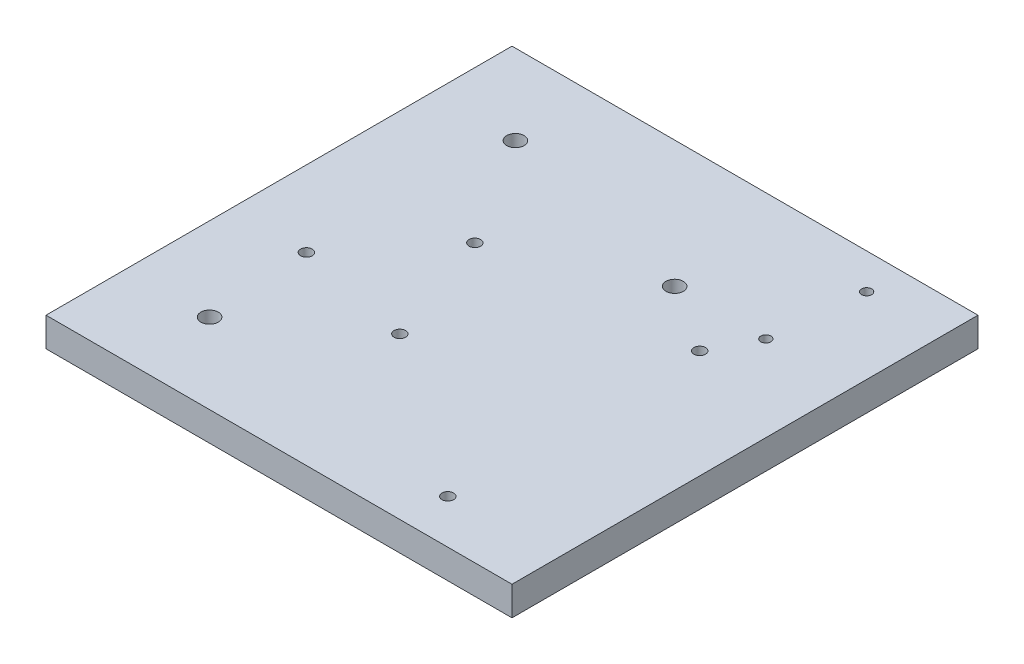
ISO-10303-21;
HEADER;
FILE_DESCRIPTION(('STEP AP214'),'2;1');
FILE_NAME('part.step','',(''),(''),'','','');
FILE_SCHEMA(('AUTOMOTIVE_DESIGN { 1 0 10303 214 1 1 1 1 }'));
ENDSEC;
DATA;
#1=APPLICATION_CONTEXT('core data for automotive mechanical design processes');
#2=APPLICATION_PROTOCOL_DEFINITION('international standard','automotive_design',2000,#1);
#3=PRODUCT_CONTEXT('',#1,'mechanical');
#4=PRODUCT('Part','Part','',(#3));
#5=PRODUCT_RELATED_PRODUCT_CATEGORY('part','',(#4));
#6=PRODUCT_DEFINITION_FORMATION('','',#4);
#7=PRODUCT_DEFINITION_CONTEXT('part definition',#1,'design');
#8=PRODUCT_DEFINITION('design','',#6,#7);
#9=PRODUCT_DEFINITION_SHAPE('','',#8);
#10=(LENGTH_UNIT() NAMED_UNIT(*) SI_UNIT(.MILLI.,.METRE.));
#11=(NAMED_UNIT(*) PLANE_ANGLE_UNIT() SI_UNIT($,.RADIAN.));
#12=(NAMED_UNIT(*) SI_UNIT($,.STERADIAN.) SOLID_ANGLE_UNIT());
#13=UNCERTAINTY_MEASURE_WITH_UNIT(LENGTH_MEASURE(1.E-05),#10,'distance_accuracy_value','');
#14=(GEOMETRIC_REPRESENTATION_CONTEXT(3) GLOBAL_UNCERTAINTY_ASSIGNED_CONTEXT((#13)) GLOBAL_UNIT_ASSIGNED_CONTEXT((#10,
#11,#12)) REPRESENTATION_CONTEXT('',''));
#15=CARTESIAN_POINT('',(0.,0.,0.));
#16=DIRECTION('',(0.,0.,1.));
#17=DIRECTION('',(1.,0.,0.));
#18=AXIS2_PLACEMENT_3D('',#15,#16,#17);
#19=CARTESIAN_POINT('',(-50.8,6.35,50.8));
#20=DIRECTION('',(1.,0.,0.));
#21=DIRECTION('',(0.,0.,-1.));
#22=AXIS2_PLACEMENT_3D('',#19,#20,#21);
#23=PLANE('',#22);
#24=DIRECTION('',(0.,0.,1.));
#25=VECTOR('',#24,1.);
#26=CARTESIAN_POINT('',(-50.8,0.,50.8));
#27=LINE('',#26,#25);
#28=CARTESIAN_POINT('',(-50.8,0.,-50.8));
#29=VERTEX_POINT('',#28);
#30=CARTESIAN_POINT('',(-50.8,0.,50.8));
#31=VERTEX_POINT('',#30);
#32=EDGE_CURVE('E96',#29,#31,#27,.T.);
#33=ORIENTED_EDGE('',*,*,#32,.T.);
#34=DIRECTION('',(0.,-1.,0.));
#35=VECTOR('',#34,1.);
#36=CARTESIAN_POINT('',(-50.8,6.35,50.8));
#37=LINE('',#36,#35);
#38=CARTESIAN_POINT('',(-50.8,6.35,50.8));
#39=VERTEX_POINT('',#38);
#40=EDGE_CURVE('E11',#39,#31,#37,.T.);
#41=ORIENTED_EDGE('',*,*,#40,.F.);
#42=DIRECTION('',(0.,0.,1.));
#43=VECTOR('',#42,1.);
#44=CARTESIAN_POINT('',(-50.8,6.35,50.8));
#45=LINE('',#44,#43);
#46=CARTESIAN_POINT('',(-50.8,6.35,-50.8));
#47=VERTEX_POINT('',#46);
#48=EDGE_CURVE('E84',#47,#39,#45,.T.);
#49=ORIENTED_EDGE('',*,*,#48,.F.);
#50=DIRECTION('',(0.,-1.,0.));
#51=VECTOR('',#50,1.);
#52=CARTESIAN_POINT('',(-50.8,6.35,-50.8));
#53=LINE('',#52,#51);
#54=EDGE_CURVE('E92',#47,#29,#53,.T.);
#55=ORIENTED_EDGE('',*,*,#54,.T.);
#56=EDGE_LOOP('',(#33,#41,#49,#55));
#57=FACE_BOUND('',#56,.T.);
#58=ADVANCED_FACE('F33',(#57),#23,.F.);
#59=CARTESIAN_POINT('',(50.8,6.35,50.8));
#60=DIRECTION('',(0.,0.,-1.));
#61=DIRECTION('',(-1.,0.,0.));
#62=AXIS2_PLACEMENT_3D('',#59,#60,#61);
#63=PLANE('',#62);
#64=DIRECTION('',(1.,0.,0.));
#65=VECTOR('',#64,1.);
#66=CARTESIAN_POINT('',(50.8,0.,50.8));
#67=LINE('',#66,#65);
#68=CARTESIAN_POINT('',(50.8,0.,50.8));
#69=VERTEX_POINT('',#68);
#70=EDGE_CURVE('E88',#31,#69,#67,.T.);
#71=ORIENTED_EDGE('',*,*,#70,.T.);
#72=DIRECTION('',(0.,-1.,0.));
#73=VECTOR('',#72,1.);
#74=CARTESIAN_POINT('',(50.8,6.35,50.8));
#75=LINE('',#74,#73);
#76=CARTESIAN_POINT('',(50.8,6.35,50.8));
#77=VERTEX_POINT('',#76);
#78=EDGE_CURVE('E41',#77,#69,#75,.T.);
#79=ORIENTED_EDGE('',*,*,#78,.F.);
#80=DIRECTION('',(1.,0.,0.));
#81=VECTOR('',#80,1.);
#82=CARTESIAN_POINT('',(50.8,6.35,50.8));
#83=LINE('',#82,#81);
#84=EDGE_CURVE('E79',#39,#77,#83,.T.);
#85=ORIENTED_EDGE('',*,*,#84,.F.);
#86=ORIENTED_EDGE('',*,*,#40,.T.);
#87=EDGE_LOOP('',(#71,#79,#85,#86));
#88=FACE_BOUND('',#87,.T.);
#89=ADVANCED_FACE('F87',(#88),#63,.F.);
#90=CARTESIAN_POINT('',(50.8,6.35,50.8));
#91=DIRECTION('',(-1.,0.,0.));
#92=DIRECTION('',(0.,0.,1.));
#93=AXIS2_PLACEMENT_3D('',#90,#91,#92);
#94=PLANE('',#93);
#95=DIRECTION('',(0.,0.,-1.));
#96=VECTOR('',#95,1.);
#97=CARTESIAN_POINT('',(50.8,0.,50.8));
#98=LINE('',#97,#96);
#99=CARTESIAN_POINT('',(50.8,0.,-50.8));
#100=VERTEX_POINT('',#99);
#101=EDGE_CURVE('E66',#69,#100,#98,.T.);
#102=ORIENTED_EDGE('',*,*,#101,.T.);
#103=DIRECTION('',(0.,-1.,0.));
#104=VECTOR('',#103,1.);
#105=CARTESIAN_POINT('',(50.8,6.35,-50.8));
#106=LINE('',#105,#104);
#107=CARTESIAN_POINT('',(50.8,6.35,-50.8));
#108=VERTEX_POINT('',#107);
#109=EDGE_CURVE('E89',#108,#100,#106,.T.);
#110=ORIENTED_EDGE('',*,*,#109,.F.);
#111=DIRECTION('',(0.,0.,-1.));
#112=VECTOR('',#111,1.);
#113=CARTESIAN_POINT('',(50.8,6.35,50.8));
#114=LINE('',#113,#112);
#115=EDGE_CURVE('E82',#77,#108,#114,.T.);
#116=ORIENTED_EDGE('',*,*,#115,.F.);
#117=ORIENTED_EDGE('',*,*,#78,.T.);
#118=EDGE_LOOP('',(#102,#110,#116,#117));
#119=FACE_BOUND('',#118,.T.);
#120=ADVANCED_FACE('F90',(#119),#94,.F.);
#121=CARTESIAN_POINT('',(50.8,6.35,-50.8));
#122=DIRECTION('',(0.,0.,1.));
#123=DIRECTION('',(1.,0.,0.));
#124=AXIS2_PLACEMENT_3D('',#121,#122,#123);
#125=PLANE('',#124);
#126=DIRECTION('',(-1.,0.,0.));
#127=VECTOR('',#126,1.);
#128=CARTESIAN_POINT('',(50.8,0.,-50.8));
#129=LINE('',#128,#127);
#130=EDGE_CURVE('E72',#100,#29,#129,.T.);
#131=ORIENTED_EDGE('',*,*,#130,.T.);
#132=ORIENTED_EDGE('',*,*,#54,.F.);
#133=DIRECTION('',(-1.,0.,0.));
#134=VECTOR('',#133,1.);
#135=CARTESIAN_POINT('',(50.8,6.35,-50.8));
#136=LINE('',#135,#134);
#137=EDGE_CURVE('E49',#108,#47,#136,.T.);
#138=ORIENTED_EDGE('',*,*,#137,.F.);
#139=ORIENTED_EDGE('',*,*,#109,.T.);
#140=EDGE_LOOP('',(#131,#132,#138,#139));
#141=FACE_BOUND('',#140,.T.);
#142=ADVANCED_FACE('F104',(#141),#125,.F.);
#143=CARTESIAN_POINT('',(-50.8,6.35,-50.8));
#144=DIRECTION('',(0.,1.,0.));
#145=DIRECTION('',(0.,0.,1.));
#146=AXIS2_PLACEMENT_3D('',#143,#144,#145);
#147=PLANE('',#146);
#148=CARTESIAN_POINT('',(32.1481788724814,6.35,-23.1914174439432));
#149=DIRECTION('',(0.,1.,0.));
#150=DIRECTION('',(0.,0.,1.));
#151=AXIS2_PLACEMENT_3D('',#148,#149,#150);
#152=CIRCLE('',#151,1.09999999999999);
#153=CARTESIAN_POINT('',(32.1481788724814,6.35,-22.0914174439432));
#154=VERTEX_POINT('',#153);
#155=EDGE_CURVE('E164',#154,#154,#152,.T.);
#156=ORIENTED_EDGE('',*,*,#155,.F.);
#157=EDGE_LOOP('',(#156));
#158=FACE_BOUND('',#157,.T.);
#159=CARTESIAN_POINT('',(34.2387481378345,6.35,-43.0818553513086));
#160=DIRECTION('',(0.,1.,0.));
#161=DIRECTION('',(0.,0.,1.));
#162=AXIS2_PLACEMENT_3D('',#159,#160,#161);
#163=CIRCLE('',#162,1.09999999999999);
#164=CARTESIAN_POINT('',(34.2387481378345,6.35,-41.9818553513086));
#165=VERTEX_POINT('',#164);
#166=EDGE_CURVE('E158',#165,#165,#163,.T.);
#167=ORIENTED_EDGE('',*,*,#166,.F.);
#168=EDGE_LOOP('',(#167));
#169=FACE_BOUND('',#168,.T.);
#170=CARTESIAN_POINT('',(12.2807386859692,6.35,-23.1774999999993));
#171=DIRECTION('',(0.,1.,0.));
#172=DIRECTION('',(0.,0.,1.));
#173=AXIS2_PLACEMENT_3D('',#170,#171,#172);
#174=CIRCLE('',#173,1.89865);
#175=CARTESIAN_POINT('',(12.2807386859692,6.35,-21.2788499999993));
#176=VERTEX_POINT('',#175);
#177=EDGE_CURVE('E152',#176,#176,#174,.T.);
#178=ORIENTED_EDGE('',*,*,#177,.F.);
#179=EDGE_LOOP('',(#178));
#180=FACE_BOUND('',#179,.T.);
#181=CARTESIAN_POINT('',(-32.6007386859686,6.35,33.3375000000003));
#182=DIRECTION('',(0.,-1.,0.));
#183=DIRECTION('',(0.,0.,-1.));
#184=AXIS2_PLACEMENT_3D('',#181,#182,#183);
#185=CIRCLE('',#184,1.89865);
#186=CARTESIAN_POINT('',(-32.6007386859686,6.35,31.4388500000003));
#187=VERTEX_POINT('',#186);
#188=EDGE_CURVE('E143',#187,#187,#185,.T.);
#189=ORIENTED_EDGE('',*,*,#188,.T.);
#190=EDGE_LOOP('',(#189));
#191=FACE_BOUND('',#190,.T.);
#192=CARTESIAN_POINT('',(-32.6007386859686,6.35,-33.3374999999997));
#193=DIRECTION('',(0.,-1.,0.));
#194=DIRECTION('',(0.,0.,-1.));
#195=AXIS2_PLACEMENT_3D('',#192,#193,#194);
#196=CIRCLE('',#195,1.89865);
#197=CARTESIAN_POINT('',(-32.6007386859686,6.35,-35.2361499999997));
#198=VERTEX_POINT('',#197);
#199=EDGE_CURVE('E137',#198,#198,#196,.T.);
#200=ORIENTED_EDGE('',*,*,#199,.T.);
#201=EDGE_LOOP('',(#200));
#202=FACE_BOUND('',#201,.T.);
#203=CARTESIAN_POINT('',(27.2,6.35,-13.7211770524215));
#204=DIRECTION('',(0.,-1.,0.));
#205=DIRECTION('',(0.,0.,-1.));
#206=AXIS2_PLACEMENT_3D('',#203,#204,#205);
#207=CIRCLE('',#206,1.27000000000005);
#208=CARTESIAN_POINT('',(27.2,6.35,-14.9911770524216));
#209=VERTEX_POINT('',#208);
#210=EDGE_CURVE('E131',#209,#209,#207,.T.);
#211=ORIENTED_EDGE('',*,*,#210,.T.);
#212=EDGE_LOOP('',(#211));
#213=FACE_BOUND('',#212,.T.);
#214=CARTESIAN_POINT('',(27.2,6.35,41.1988229475785));
#215=DIRECTION('',(0.,-1.,0.));
#216=DIRECTION('',(0.,0.,-1.));
#217=AXIS2_PLACEMENT_3D('',#214,#215,#216);
#218=CIRCLE('',#217,1.27000000000005);
#219=CARTESIAN_POINT('',(27.2,6.35,39.9288229475784));
#220=VERTEX_POINT('',#219);
#221=EDGE_CURVE('E125',#220,#220,#218,.T.);
#222=ORIENTED_EDGE('',*,*,#221,.T.);
#223=EDGE_LOOP('',(#222));
#224=FACE_BOUND('',#223,.T.);
#225=CARTESIAN_POINT('',(-17.7149310523231,6.35,-9.61074588253205));
#226=DIRECTION('',(0.,-1.,0.));
#227=DIRECTION('',(0.,0.,-1.));
#228=AXIS2_PLACEMENT_3D('',#225,#226,#227);
#229=CIRCLE('',#228,1.26999999999999);
#230=CARTESIAN_POINT('',(-17.7149310523231,6.35,-10.880745882532));
#231=VERTEX_POINT('',#230);
#232=EDGE_CURVE('E119',#231,#231,#229,.T.);
#233=ORIENTED_EDGE('',*,*,#232,.T.);
#234=EDGE_LOOP('',(#233));
#235=FACE_BOUND('',#234,.T.);
#236=CARTESIAN_POINT('',(-34.2625629227483,6.35,10.563822947579));
#237=DIRECTION('',(0.,-1.,0.));
#238=DIRECTION('',(0.,0.,-1.));
#239=AXIS2_PLACEMENT_3D('',#236,#237,#238);
#240=CIRCLE('',#239,1.27000000000001);
#241=CARTESIAN_POINT('',(-34.2625629227483,6.35,9.29382294757898));
#242=VERTEX_POINT('',#241);
#243=EDGE_CURVE('E113',#242,#242,#240,.T.);
#244=ORIENTED_EDGE('',*,*,#243,.T.);
#245=EDGE_LOOP('',(#244));
#246=FACE_BOUND('',#245,.T.);
#247=CARTESIAN_POINT('',(-8.69154602444201,6.35,15.7561675804543));
#248=DIRECTION('',(0.,-1.,0.));
#249=DIRECTION('',(0.,0.,-1.));
#250=AXIS2_PLACEMENT_3D('',#247,#248,#249);
#251=CIRCLE('',#250,1.26999999999987);
#252=CARTESIAN_POINT('',(-8.69154602444201,6.35,14.4861675804545));
#253=VERTEX_POINT('',#252);
#254=EDGE_CURVE('E99',#253,#253,#251,.T.);
#255=ORIENTED_EDGE('',*,*,#254,.T.);
#256=EDGE_LOOP('',(#255));
#257=FACE_BOUND('',#256,.T.);
#258=ORIENTED_EDGE('',*,*,#48,.T.);
#259=ORIENTED_EDGE('',*,*,#84,.T.);
#260=ORIENTED_EDGE('',*,*,#115,.T.);
#261=ORIENTED_EDGE('',*,*,#137,.T.);
#262=EDGE_LOOP('',(#258,#259,#260,#261));
#263=FACE_BOUND('',#262,.T.);
#264=ADVANCED_FACE('F80',(#158,#169,#180,#191,#202,#213,#224,#235,#246,#257,#263),#147,.T.);
#265=CARTESIAN_POINT('',(-50.8,0.,-50.8));
#266=DIRECTION('',(0.,1.,0.));
#267=DIRECTION('',(0.,0.,1.));
#268=AXIS2_PLACEMENT_3D('',#265,#266,#267);
#269=PLANE('',#268);
#270=CARTESIAN_POINT('',(32.1481788724814,0.,-23.1914174439432));
#271=DIRECTION('',(0.,1.,0.));
#272=DIRECTION('',(0.,0.,1.));
#273=AXIS2_PLACEMENT_3D('',#270,#271,#272);
#274=CIRCLE('',#273,1.09999999999999);
#275=CARTESIAN_POINT('',(32.1481788724814,0.,-22.0914174439432));
#276=VERTEX_POINT('',#275);
#277=EDGE_CURVE('E161',#276,#276,#274,.T.);
#278=ORIENTED_EDGE('',*,*,#277,.T.);
#279=EDGE_LOOP('',(#278));
#280=FACE_BOUND('',#279,.T.);
#281=CARTESIAN_POINT('',(34.2387481378345,0.,-43.0818553513086));
#282=DIRECTION('',(0.,1.,0.));
#283=DIRECTION('',(0.,0.,1.));
#284=AXIS2_PLACEMENT_3D('',#281,#282,#283);
#285=CIRCLE('',#284,1.09999999999999);
#286=CARTESIAN_POINT('',(34.2387481378345,0.,-41.9818553513086));
#287=VERTEX_POINT('',#286);
#288=EDGE_CURVE('E155',#287,#287,#285,.T.);
#289=ORIENTED_EDGE('',*,*,#288,.T.);
#290=EDGE_LOOP('',(#289));
#291=FACE_BOUND('',#290,.T.);
#292=CARTESIAN_POINT('',(12.2807386859692,0.,-23.1774999999993));
#293=DIRECTION('',(0.,1.,0.));
#294=DIRECTION('',(0.,0.,1.));
#295=AXIS2_PLACEMENT_3D('',#292,#293,#294);
#296=CIRCLE('',#295,1.89865);
#297=CARTESIAN_POINT('',(12.2807386859692,0.,-21.2788499999993));
#298=VERTEX_POINT('',#297);
#299=EDGE_CURVE('E149',#298,#298,#296,.T.);
#300=ORIENTED_EDGE('',*,*,#299,.T.);
#301=EDGE_LOOP('',(#300));
#302=FACE_BOUND('',#301,.T.);
#303=CARTESIAN_POINT('',(-32.6007386859686,0.,33.3375000000003));
#304=DIRECTION('',(0.,-1.,0.));
#305=DIRECTION('',(0.,0.,-1.));
#306=AXIS2_PLACEMENT_3D('',#303,#304,#305);
#307=CIRCLE('',#306,1.89865);
#308=CARTESIAN_POINT('',(-32.6007386859686,0.,31.4388500000003));
#309=VERTEX_POINT('',#308);
#310=EDGE_CURVE('E146',#309,#309,#307,.T.);
#311=ORIENTED_EDGE('',*,*,#310,.F.);
#312=EDGE_LOOP('',(#311));
#313=FACE_BOUND('',#312,.T.);
#314=CARTESIAN_POINT('',(-32.6007386859686,0.,-33.3374999999997));
#315=DIRECTION('',(0.,-1.,0.));
#316=DIRECTION('',(0.,0.,-1.));
#317=AXIS2_PLACEMENT_3D('',#314,#315,#316);
#318=CIRCLE('',#317,1.89865);
#319=CARTESIAN_POINT('',(-32.6007386859686,0.,-35.2361499999997));
#320=VERTEX_POINT('',#319);
#321=EDGE_CURVE('E140',#320,#320,#318,.T.);
#322=ORIENTED_EDGE('',*,*,#321,.F.);
#323=EDGE_LOOP('',(#322));
#324=FACE_BOUND('',#323,.T.);
#325=CARTESIAN_POINT('',(27.2,0.,-13.7211770524215));
#326=DIRECTION('',(0.,-1.,0.));
#327=DIRECTION('',(0.,0.,-1.));
#328=AXIS2_PLACEMENT_3D('',#325,#326,#327);
#329=CIRCLE('',#328,1.27000000000005);
#330=CARTESIAN_POINT('',(27.2,0.,-14.9911770524216));
#331=VERTEX_POINT('',#330);
#332=EDGE_CURVE('E134',#331,#331,#329,.T.);
#333=ORIENTED_EDGE('',*,*,#332,.F.);
#334=EDGE_LOOP('',(#333));
#335=FACE_BOUND('',#334,.T.);
#336=CARTESIAN_POINT('',(27.2,0.,41.1988229475785));
#337=DIRECTION('',(0.,-1.,0.));
#338=DIRECTION('',(0.,0.,-1.));
#339=AXIS2_PLACEMENT_3D('',#336,#337,#338);
#340=CIRCLE('',#339,1.27000000000005);
#341=CARTESIAN_POINT('',(27.2,0.,39.9288229475784));
#342=VERTEX_POINT('',#341);
#343=EDGE_CURVE('E128',#342,#342,#340,.T.);
#344=ORIENTED_EDGE('',*,*,#343,.F.);
#345=EDGE_LOOP('',(#344));
#346=FACE_BOUND('',#345,.T.);
#347=CARTESIAN_POINT('',(-17.7149310523231,0.,-9.61074588253205));
#348=DIRECTION('',(0.,-1.,0.));
#349=DIRECTION('',(0.,0.,-1.));
#350=AXIS2_PLACEMENT_3D('',#347,#348,#349);
#351=CIRCLE('',#350,1.26999999999999);
#352=CARTESIAN_POINT('',(-17.7149310523231,0.,-10.880745882532));
#353=VERTEX_POINT('',#352);
#354=EDGE_CURVE('E122',#353,#353,#351,.T.);
#355=ORIENTED_EDGE('',*,*,#354,.F.);
#356=EDGE_LOOP('',(#355));
#357=FACE_BOUND('',#356,.T.);
#358=CARTESIAN_POINT('',(-34.2625629227483,0.,10.563822947579));
#359=DIRECTION('',(0.,-1.,0.));
#360=DIRECTION('',(0.,0.,-1.));
#361=AXIS2_PLACEMENT_3D('',#358,#359,#360);
#362=CIRCLE('',#361,1.27000000000001);
#363=CARTESIAN_POINT('',(-34.2625629227483,0.,9.29382294757898));
#364=VERTEX_POINT('',#363);
#365=EDGE_CURVE('E116',#364,#364,#362,.T.);
#366=ORIENTED_EDGE('',*,*,#365,.F.);
#367=EDGE_LOOP('',(#366));
#368=FACE_BOUND('',#367,.T.);
#369=CARTESIAN_POINT('',(-8.69154602444201,0.,15.7561675804543));
#370=DIRECTION('',(0.,-1.,0.));
#371=DIRECTION('',(0.,0.,-1.));
#372=AXIS2_PLACEMENT_3D('',#369,#370,#371);
#373=CIRCLE('',#372,1.26999999999987);
#374=CARTESIAN_POINT('',(-8.69154602444201,0.,14.4861675804545));
#375=VERTEX_POINT('',#374);
#376=EDGE_CURVE('E110',#375,#375,#373,.T.);
#377=ORIENTED_EDGE('',*,*,#376,.F.);
#378=EDGE_LOOP('',(#377));
#379=FACE_BOUND('',#378,.T.);
#380=ORIENTED_EDGE('',*,*,#32,.F.);
#381=ORIENTED_EDGE('',*,*,#130,.F.);
#382=ORIENTED_EDGE('',*,*,#101,.F.);
#383=ORIENTED_EDGE('',*,*,#70,.F.);
#384=EDGE_LOOP('',(#380,#381,#382,#383));
#385=FACE_BOUND('',#384,.T.);
#386=ADVANCED_FACE('F107',(#280,#291,#302,#313,#324,#335,#346,#357,#368,#379,#385),#269,.F.);
#387=CARTESIAN_POINT('',(-8.69154602444201,6.35,15.7561675804543));
#388=DIRECTION('',(0.,-1.,0.));
#389=DIRECTION('',(0.,0.,-1.));
#390=AXIS2_PLACEMENT_3D('',#387,#388,#389);
#391=CYLINDRICAL_SURFACE('',#390,1.26999999999987);
#392=ORIENTED_EDGE('',*,*,#254,.F.);
#393=EDGE_LOOP('',(#392));
#394=FACE_BOUND('',#393,.T.);
#395=ORIENTED_EDGE('',*,*,#376,.T.);
#396=EDGE_LOOP('',(#395));
#397=FACE_BOUND('',#396,.T.);
#398=ADVANCED_FACE('F200',(#394,#397),#391,.F.);
#399=CARTESIAN_POINT('',(-34.2625629227483,6.35,10.563822947579));
#400=DIRECTION('',(0.,-1.,0.));
#401=DIRECTION('',(0.,0.,-1.));
#402=AXIS2_PLACEMENT_3D('',#399,#400,#401);
#403=CYLINDRICAL_SURFACE('',#402,1.27000000000001);
#404=ORIENTED_EDGE('',*,*,#243,.F.);
#405=EDGE_LOOP('',(#404));
#406=FACE_BOUND('',#405,.T.);
#407=ORIENTED_EDGE('',*,*,#365,.T.);
#408=EDGE_LOOP('',(#407));
#409=FACE_BOUND('',#408,.T.);
#410=ADVANCED_FACE('F203',(#406,#409),#403,.F.);
#411=CARTESIAN_POINT('',(-17.7149310523231,6.35,-9.61074588253205));
#412=DIRECTION('',(0.,-1.,0.));
#413=DIRECTION('',(0.,0.,-1.));
#414=AXIS2_PLACEMENT_3D('',#411,#412,#413);
#415=CYLINDRICAL_SURFACE('',#414,1.26999999999999);
#416=ORIENTED_EDGE('',*,*,#232,.F.);
#417=EDGE_LOOP('',(#416));
#418=FACE_BOUND('',#417,.T.);
#419=ORIENTED_EDGE('',*,*,#354,.T.);
#420=EDGE_LOOP('',(#419));
#421=FACE_BOUND('',#420,.T.);
#422=ADVANCED_FACE('F291',(#418,#421),#415,.F.);
#423=CARTESIAN_POINT('',(27.2,6.35,41.1988229475785));
#424=DIRECTION('',(0.,-1.,0.));
#425=DIRECTION('',(0.,0.,-1.));
#426=AXIS2_PLACEMENT_3D('',#423,#424,#425);
#427=CYLINDRICAL_SURFACE('',#426,1.27000000000005);
#428=ORIENTED_EDGE('',*,*,#221,.F.);
#429=EDGE_LOOP('',(#428));
#430=FACE_BOUND('',#429,.T.);
#431=ORIENTED_EDGE('',*,*,#343,.T.);
#432=EDGE_LOOP('',(#431));
#433=FACE_BOUND('',#432,.T.);
#434=ADVANCED_FACE('F283',(#430,#433),#427,.F.);
#435=CARTESIAN_POINT('',(27.2,6.35,-13.7211770524215));
#436=DIRECTION('',(0.,-1.,0.));
#437=DIRECTION('',(0.,0.,-1.));
#438=AXIS2_PLACEMENT_3D('',#435,#436,#437);
#439=CYLINDRICAL_SURFACE('',#438,1.27000000000005);
#440=ORIENTED_EDGE('',*,*,#210,.F.);
#441=EDGE_LOOP('',(#440));
#442=FACE_BOUND('',#441,.T.);
#443=ORIENTED_EDGE('',*,*,#332,.T.);
#444=EDGE_LOOP('',(#443));
#445=FACE_BOUND('',#444,.T.);
#446=ADVANCED_FACE('F275',(#442,#445),#439,.F.);
#447=CARTESIAN_POINT('',(-32.6007386859686,6.35,-33.3374999999997));
#448=DIRECTION('',(0.,-1.,0.));
#449=DIRECTION('',(0.,0.,-1.));
#450=AXIS2_PLACEMENT_3D('',#447,#448,#449);
#451=CYLINDRICAL_SURFACE('',#450,1.89865);
#452=ORIENTED_EDGE('',*,*,#199,.F.);
#453=EDGE_LOOP('',(#452));
#454=FACE_BOUND('',#453,.T.);
#455=ORIENTED_EDGE('',*,*,#321,.T.);
#456=EDGE_LOOP('',(#455));
#457=FACE_BOUND('',#456,.T.);
#458=ADVANCED_FACE('F267',(#454,#457),#451,.F.);
#459=CARTESIAN_POINT('',(-32.6007386859686,6.35,33.3375000000003));
#460=DIRECTION('',(0.,-1.,0.));
#461=DIRECTION('',(0.,0.,-1.));
#462=AXIS2_PLACEMENT_3D('',#459,#460,#461);
#463=CYLINDRICAL_SURFACE('',#462,1.89865);
#464=ORIENTED_EDGE('',*,*,#188,.F.);
#465=EDGE_LOOP('',(#464));
#466=FACE_BOUND('',#465,.T.);
#467=ORIENTED_EDGE('',*,*,#310,.T.);
#468=EDGE_LOOP('',(#467));
#469=FACE_BOUND('',#468,.T.);
#470=ADVANCED_FACE('F262',(#466,#469),#463,.F.);
#471=CARTESIAN_POINT('',(12.2807386859692,0.,-23.1774999999993));
#472=DIRECTION('',(0.,1.,0.));
#473=DIRECTION('',(0.,0.,1.));
#474=AXIS2_PLACEMENT_3D('',#471,#472,#473);
#475=CYLINDRICAL_SURFACE('',#474,1.89865);
#476=ORIENTED_EDGE('',*,*,#299,.F.);
#477=EDGE_LOOP('',(#476));
#478=FACE_BOUND('',#477,.T.);
#479=ORIENTED_EDGE('',*,*,#177,.T.);
#480=EDGE_LOOP('',(#479));
#481=FACE_BOUND('',#480,.T.);
#482=ADVANCED_FACE('F236',(#478,#481),#475,.F.);
#483=CARTESIAN_POINT('',(34.2387481378345,0.,-43.0818553513086));
#484=DIRECTION('',(0.,1.,0.));
#485=DIRECTION('',(0.,0.,1.));
#486=AXIS2_PLACEMENT_3D('',#483,#484,#485);
#487=CYLINDRICAL_SURFACE('',#486,1.09999999999999);
#488=ORIENTED_EDGE('',*,*,#288,.F.);
#489=EDGE_LOOP('',(#488));
#490=FACE_BOUND('',#489,.T.);
#491=ORIENTED_EDGE('',*,*,#166,.T.);
#492=EDGE_LOOP('',(#491));
#493=FACE_BOUND('',#492,.T.);
#494=ADVANCED_FACE('F175',(#490,#493),#487,.F.);
#495=CARTESIAN_POINT('',(32.1481788724814,0.,-23.1914174439432));
#496=DIRECTION('',(0.,1.,0.));
#497=DIRECTION('',(0.,0.,1.));
#498=AXIS2_PLACEMENT_3D('',#495,#496,#497);
#499=CYLINDRICAL_SURFACE('',#498,1.09999999999999);
#500=ORIENTED_EDGE('',*,*,#277,.F.);
#501=EDGE_LOOP('',(#500));
#502=FACE_BOUND('',#501,.T.);
#503=ORIENTED_EDGE('',*,*,#155,.T.);
#504=EDGE_LOOP('',(#503));
#505=FACE_BOUND('',#504,.T.);
#506=ADVANCED_FACE('F172',(#502,#505),#499,.F.);
#507=CLOSED_SHELL('',(#58,#89,#120,#142,#264,#386,#398,#410,#422,#434,#446,#458,#470,#482,#494,#506));
#508=MANIFOLD_SOLID_BREP('B2',#507);
#509=ADVANCED_BREP_SHAPE_REPRESENTATION('',(#18,#508),#14);
#510=SHAPE_DEFINITION_REPRESENTATION(#9,#509);
ENDSEC;
END-ISO-10303-21;
